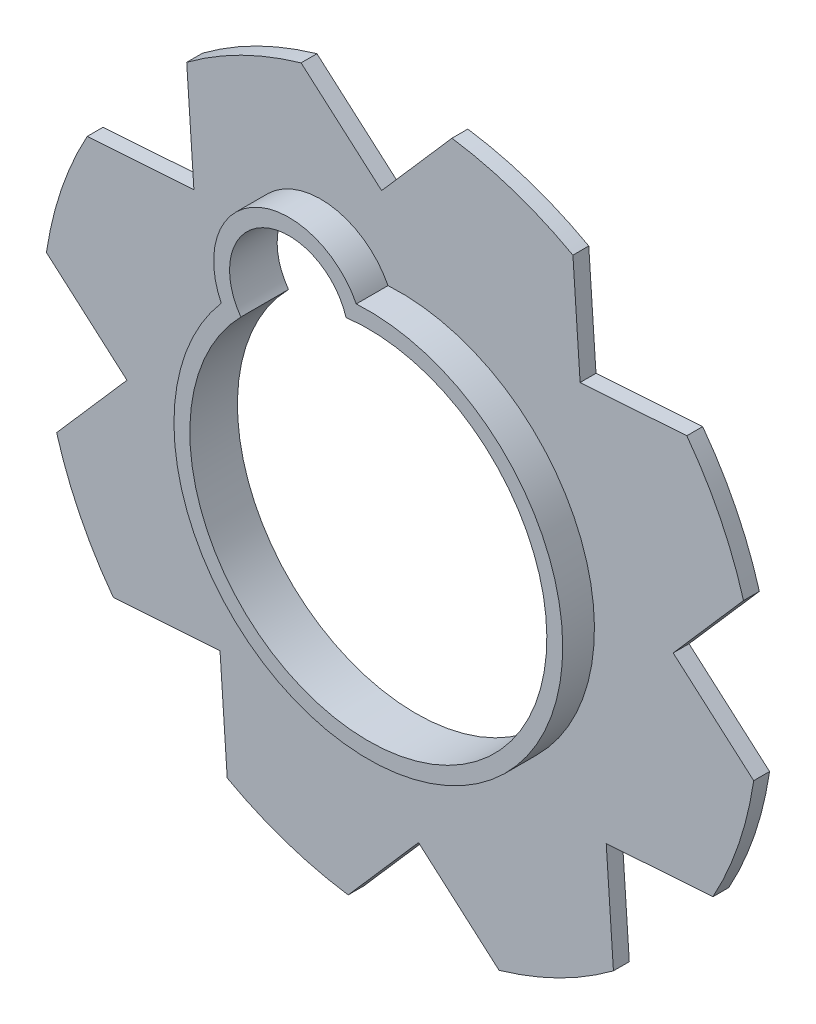
ISO-10303-21;
HEADER;
FILE_DESCRIPTION(('STEP AP214'),'2;1');
FILE_NAME('part.step','',(''),(''),'','','');
FILE_SCHEMA(('AUTOMOTIVE_DESIGN { 1 0 10303 214 1 1 1 1 }'));
ENDSEC;
DATA;
#1=APPLICATION_CONTEXT('core data for automotive mechanical design processes');
#2=APPLICATION_PROTOCOL_DEFINITION('international standard','automotive_design',2000,#1);
#3=PRODUCT_CONTEXT('',#1,'mechanical');
#4=PRODUCT('Part','Part','',(#3));
#5=PRODUCT_RELATED_PRODUCT_CATEGORY('part','',(#4));
#6=PRODUCT_DEFINITION_FORMATION('','',#4);
#7=PRODUCT_DEFINITION_CONTEXT('part definition',#1,'design');
#8=PRODUCT_DEFINITION('design','',#6,#7);
#9=PRODUCT_DEFINITION_SHAPE('','',#8);
#10=(LENGTH_UNIT() NAMED_UNIT(*) SI_UNIT(.MILLI.,.METRE.));
#11=(NAMED_UNIT(*) PLANE_ANGLE_UNIT() SI_UNIT($,.RADIAN.));
#12=(NAMED_UNIT(*) SI_UNIT($,.STERADIAN.) SOLID_ANGLE_UNIT());
#13=UNCERTAINTY_MEASURE_WITH_UNIT(LENGTH_MEASURE(1.E-05),#10,'distance_accuracy_value','');
#14=(GEOMETRIC_REPRESENTATION_CONTEXT(3) GLOBAL_UNCERTAINTY_ASSIGNED_CONTEXT((#13)) GLOBAL_UNIT_ASSIGNED_CONTEXT((#10,
#11,#12)) REPRESENTATION_CONTEXT('',''));
#15=CARTESIAN_POINT('',(0.,0.,0.));
#16=DIRECTION('',(0.,0.,1.));
#17=DIRECTION('',(1.,0.,0.));
#18=AXIS2_PLACEMENT_3D('',#15,#16,#17);
#19=CARTESIAN_POINT('',(0.,0.,2.));
#20=DIRECTION('',(0.,0.,1.));
#21=DIRECTION('',(1.,0.,0.));
#22=AXIS2_PLACEMENT_3D('',#19,#20,#21);
#23=PLANE('',#22);
#24=CARTESIAN_POINT('',(0.,0.,2.));
#25=DIRECTION('',(0.,0.,1.));
#26=DIRECTION('',(1.,0.,0.));
#27=AXIS2_PLACEMENT_3D('',#24,#25,#26);
#28=CIRCLE('',#27,45.05);
#29=CARTESIAN_POINT('',(-21.7857233383085,-39.4320270671783,2.));
#30=VERTEX_POINT('',#29);
#31=CARTESIAN_POINT('',(-6.53955185475153,-44.5728253708357,2.));
#32=VERTEX_POINT('',#31);
#33=EDGE_CURVE('E253',#30,#32,#28,.T.);
#34=ORIENTED_EDGE('',*,*,#33,.T.);
#35=DIRECTION('',(0.657814353968905,0.753180108415293,0.));
#36=VECTOR('',#35,1.);
#37=CARTESIAN_POINT('',(-6.53955185475153,-44.5728253708357,2.));
#38=LINE('',#37,#36);
#39=CARTESIAN_POINT('',(2.32646512233945,-34.4214694636144,2.));
#40=VERTEX_POINT('',#39);
#41=EDGE_CURVE('E256',#32,#40,#38,.T.);
#42=ORIENTED_EDGE('',*,*,#41,.T.);
#43=DIRECTION('',(0.753180108415293,-0.657814353968905,0.));
#44=VECTOR('',#43,1.);
#45=CARTESIAN_POINT('',(2.32646512233945,-34.4214694636144,2.));
#46=LINE('',#45,#44);
#47=CARTESIAN_POINT('',(12.4778210295607,-43.2874864407054,2.));
#48=VERTEX_POINT('',#47);
#49=EDGE_CURVE('E259',#40,#48,#46,.T.);
#50=ORIENTED_EDGE('',*,*,#49,.T.);
#51=CARTESIAN_POINT('',(0.,0.,2.));
#52=DIRECTION('',(0.,0.,1.));
#53=DIRECTION('',(1.,0.,0.));
#54=AXIS2_PLACEMENT_3D('',#51,#52,#53);
#55=CIRCLE('',#54,45.05);
#56=CARTESIAN_POINT('',(26.8935856139459,-36.1419085387775,2.));
#57=VERTEX_POINT('',#56);
#58=EDGE_CURVE('E261',#48,#57,#55,.T.);
#59=ORIENTED_EDGE('',*,*,#58,.T.);
#60=DIRECTION('',(-0.0674337716620119,0.997723752568533,0.));
#61=VECTOR('',#60,1.);
#62=CARTESIAN_POINT('',(26.8935856139459,-36.1419085387775,2.));
#63=LINE('',#62,#61);
#64=CARTESIAN_POINT('',(25.9847137403277,-22.6945952119272,2.));
#65=VERTEX_POINT('',#64);
#66=EDGE_CURVE('E263',#57,#65,#63,.T.);
#67=ORIENTED_EDGE('',*,*,#66,.T.);
#68=DIRECTION('',(0.997723752568533,0.0674337716620136,0.));
#69=VECTOR('',#68,1.);
#70=CARTESIAN_POINT('',(25.9847137403277,-22.6945952119272,2.));
#71=LINE('',#70,#69);
#72=CARTESIAN_POINT('',(39.432027067178,-21.7857233383089,2.));
#73=VERTEX_POINT('',#72);
#74=EDGE_CURVE('E265',#65,#73,#71,.T.);
#75=ORIENTED_EDGE('',*,*,#74,.T.);
#76=CARTESIAN_POINT('',(0.,0.,2.));
#77=DIRECTION('',(0.,0.,1.));
#78=DIRECTION('',(1.,0.,0.));
#79=AXIS2_PLACEMENT_3D('',#76,#77,#78);
#80=CIRCLE('',#79,45.05);
#81=CARTESIAN_POINT('',(44.5728253708357,-6.5395518547514,2.));
#82=VERTEX_POINT('',#81);
#83=EDGE_CURVE('E267',#73,#82,#80,.T.);
#84=ORIENTED_EDGE('',*,*,#83,.T.);
#85=DIRECTION('',(-0.753180108415294,0.657814353968903,0.));
#86=VECTOR('',#85,1.);
#87=CARTESIAN_POINT('',(44.5728253708357,-6.5395518547514,2.));
#88=LINE('',#87,#86);
#89=CARTESIAN_POINT('',(34.4214694636144,2.32646512233956,2.));
#90=VERTEX_POINT('',#89);
#91=EDGE_CURVE('E269',#82,#90,#88,.T.);
#92=ORIENTED_EDGE('',*,*,#91,.T.);
#93=DIRECTION('',(0.657814353968902,0.753180108415295,0.));
#94=VECTOR('',#93,1.);
#95=CARTESIAN_POINT('',(34.4214694636144,2.32646512233956,2.));
#96=LINE('',#95,#94);
#97=CARTESIAN_POINT('',(43.2874864407053,12.4778210295609,2.));
#98=VERTEX_POINT('',#97);
#99=EDGE_CURVE('E271',#90,#98,#96,.T.);
#100=ORIENTED_EDGE('',*,*,#99,.T.);
#101=CARTESIAN_POINT('',(0.,0.,2.));
#102=DIRECTION('',(0.,0.,1.));
#103=DIRECTION('',(1.,0.,0.));
#104=AXIS2_PLACEMENT_3D('',#101,#102,#103);
#105=CIRCLE('',#104,45.05);
#106=CARTESIAN_POINT('',(36.1419085387773,26.8935856139463,2.));
#107=VERTEX_POINT('',#106);
#108=EDGE_CURVE('E273',#98,#107,#105,.T.);
#109=ORIENTED_EDGE('',*,*,#108,.T.);
#110=DIRECTION('',(-0.997723752568532,-0.0674337716620241,0.));
#111=VECTOR('',#110,1.);
#112=CARTESIAN_POINT('',(36.1419085387773,26.8935856139463,2.));
#113=LINE('',#112,#111);
#114=CARTESIAN_POINT('',(22.6945952119269,25.9847137403279,2.));
#115=VERTEX_POINT('',#114);
#116=EDGE_CURVE('E275',#107,#115,#113,.T.);
#117=ORIENTED_EDGE('',*,*,#116,.T.);
#118=DIRECTION('',(-0.0674337716620246,0.997723752568532,0.));
#119=VECTOR('',#118,1.);
#120=CARTESIAN_POINT('',(22.6945952119269,25.9847137403279,2.));
#121=LINE('',#120,#119);
#122=CARTESIAN_POINT('',(21.7857233383085,39.4320270671783,2.));
#123=VERTEX_POINT('',#122);
#124=EDGE_CURVE('E277',#115,#123,#121,.T.);
#125=ORIENTED_EDGE('',*,*,#124,.T.);
#126=CARTESIAN_POINT('',(0.,0.,2.));
#127=DIRECTION('',(0.,0.,1.));
#128=DIRECTION('',(1.,0.,0.));
#129=AXIS2_PLACEMENT_3D('',#126,#127,#128);
#130=CIRCLE('',#129,45.05);
#131=CARTESIAN_POINT('',(6.53955185475123,44.5728253708357,2.));
#132=VERTEX_POINT('',#131);
#133=EDGE_CURVE('E279',#123,#132,#130,.T.);
#134=ORIENTED_EDGE('',*,*,#133,.T.);
#135=DIRECTION('',(-0.657814353968901,-0.753180108415296,0.));
#136=VECTOR('',#135,1.);
#137=CARTESIAN_POINT('',(6.53955185475123,44.5728253708357,2.));
#138=LINE('',#137,#136);
#139=CARTESIAN_POINT('',(-2.32646512233969,34.4214694636144,2.));
#140=VERTEX_POINT('',#139);
#141=EDGE_CURVE('E281',#132,#140,#138,.T.);
#142=ORIENTED_EDGE('',*,*,#141,.T.);
#143=DIRECTION('',(-0.753180108415297,0.6578143539689,0.));
#144=VECTOR('',#143,1.);
#145=CARTESIAN_POINT('',(-2.32646512233969,34.4214694636144,2.));
#146=LINE('',#145,#144);
#147=CARTESIAN_POINT('',(-12.477821029561,43.2874864407053,2.));
#148=VERTEX_POINT('',#147);
#149=EDGE_CURVE('E283',#140,#148,#146,.T.);
#150=ORIENTED_EDGE('',*,*,#149,.T.);
#151=CARTESIAN_POINT('',(0.,0.,2.));
#152=DIRECTION('',(0.,0.,1.));
#153=DIRECTION('',(1.,0.,0.));
#154=AXIS2_PLACEMENT_3D('',#151,#152,#153);
#155=CIRCLE('',#154,45.05);
#156=CARTESIAN_POINT('',(-26.8935856139462,36.1419085387774,2.));
#157=VERTEX_POINT('',#156);
#158=EDGE_CURVE('E285',#148,#157,#155,.T.);
#159=ORIENTED_EDGE('',*,*,#158,.T.);
#160=DIRECTION('',(0.0674337716620215,-0.997723752568533,0.));
#161=VECTOR('',#160,1.);
#162=CARTESIAN_POINT('',(-26.8935856139462,36.1419085387774,2.));
#163=LINE('',#162,#161);
#164=CARTESIAN_POINT('',(-25.9847137403278,22.694595211927,2.));
#165=VERTEX_POINT('',#164);
#166=EDGE_CURVE('E287',#157,#165,#163,.T.);
#167=ORIENTED_EDGE('',*,*,#166,.T.);
#168=DIRECTION('',(-0.997723752568533,-0.0674337716620208,0.));
#169=VECTOR('',#168,1.);
#170=CARTESIAN_POINT('',(-25.9847137403278,22.694595211927,2.));
#171=LINE('',#170,#169);
#172=CARTESIAN_POINT('',(-39.4320270671782,21.7857233383086,2.));
#173=VERTEX_POINT('',#172);
#174=EDGE_CURVE('E289',#165,#173,#171,.T.);
#175=ORIENTED_EDGE('',*,*,#174,.T.);
#176=CARTESIAN_POINT('',(0.,0.,2.));
#177=DIRECTION('',(0.,0.,1.));
#178=DIRECTION('',(1.,0.,0.));
#179=AXIS2_PLACEMENT_3D('',#176,#177,#178);
#180=CIRCLE('',#179,45.05);
#181=CARTESIAN_POINT('',(-44.5728253708358,6.53955185475107,2.));
#182=VERTEX_POINT('',#181);
#183=EDGE_CURVE('E291',#173,#182,#180,.T.);
#184=ORIENTED_EDGE('',*,*,#183,.T.);
#185=DIRECTION('',(0.753180108415299,-0.657814353968897,0.));
#186=VECTOR('',#185,1.);
#187=CARTESIAN_POINT('',(-44.5728253708358,6.53955185475107,2.));
#188=LINE('',#187,#186);
#189=CARTESIAN_POINT('',(-34.4214694636144,-2.3264651223398,2.));
#190=VERTEX_POINT('',#189);
#191=EDGE_CURVE('E293',#182,#190,#188,.T.);
#192=ORIENTED_EDGE('',*,*,#191,.T.);
#193=DIRECTION('',(-0.657814353968897,-0.753180108415299,0.));
#194=VECTOR('',#193,1.);
#195=CARTESIAN_POINT('',(-34.4214694636144,-2.3264651223398,2.));
#196=LINE('',#195,#194);
#197=CARTESIAN_POINT('',(-43.2874864407052,-12.4778210295612,2.));
#198=VERTEX_POINT('',#197);
#199=EDGE_CURVE('E295',#190,#198,#196,.T.);
#200=ORIENTED_EDGE('',*,*,#199,.T.);
#201=CARTESIAN_POINT('',(0.,0.,2.));
#202=DIRECTION('',(0.,0.,1.));
#203=DIRECTION('',(1.,0.,0.));
#204=AXIS2_PLACEMENT_3D('',#201,#202,#203);
#205=CIRCLE('',#204,45.05);
#206=CARTESIAN_POINT('',(-36.1419085387773,-26.8935856139463,2.));
#207=VERTEX_POINT('',#206);
#208=EDGE_CURVE('E297',#198,#207,#205,.T.);
#209=ORIENTED_EDGE('',*,*,#208,.T.);
#210=DIRECTION('',(0.997723752568533,0.0674337716620222,0.));
#211=VECTOR('',#210,1.);
#212=CARTESIAN_POINT('',(-36.1419085387773,-26.8935856139463,2.));
#213=LINE('',#212,#211);
#214=CARTESIAN_POINT('',(-22.6945952119269,-25.9847137403279,2.));
#215=VERTEX_POINT('',#214);
#216=EDGE_CURVE('E299',#207,#215,#213,.T.);
#217=ORIENTED_EDGE('',*,*,#216,.T.);
#218=DIRECTION('',(0.0674337716620251,-0.997723752568532,0.));
#219=VECTOR('',#218,1.);
#220=CARTESIAN_POINT('',(-22.6945952119269,-25.9847137403279,2.));
#221=LINE('',#220,#219);
#222=EDGE_CURVE('E301',#215,#30,#221,.T.);
#223=ORIENTED_EDGE('',*,*,#222,.T.);
#224=EDGE_LOOP('',(#34,#42,#50,#59,#67,#75,#84,#92,#100,#109,#117,#125,#134,#142,#150,#159,#167,
#175,#184,#192,#200,#209,#217,#223));
#225=FACE_BOUND('',#224,.T.);
#226=CARTESIAN_POINT('',(-9.99254321153289,20.1593422552832,2.));
#227=DIRECTION('',(0.,0.,1.));
#228=DIRECTION('',(1.,0.,0.));
#229=AXIS2_PLACEMENT_3D('',#226,#227,#228);
#230=CIRCLE('',#229,9.50000000000001);
#231=CARTESIAN_POINT('',(-1.5181578262661,24.4529179611462,2.));
#232=VERTEX_POINT('',#231);
#233=CARTESIAN_POINT('',(-18.5409474354036,16.0150950105705,2.));
#234=VERTEX_POINT('',#233);
#235=EDGE_CURVE('E241',#232,#234,#230,.T.);
#236=ORIENTED_EDGE('',*,*,#235,.F.);
#237=CARTESIAN_POINT('',(0.,0.,2.));
#238=DIRECTION('',(0.,0.,1.));
#239=DIRECTION('',(1.,0.,0.));
#240=AXIS2_PLACEMENT_3D('',#237,#238,#239);
#241=CIRCLE('',#240,24.5);
#242=EDGE_CURVE('E48',#234,#232,#241,.T.);
#243=ORIENTED_EDGE('',*,*,#242,.F.);
#244=EDGE_LOOP('',(#236,#243));
#245=FACE_BOUND('',#244,.T.);
#246=ADVANCED_FACE('F33',(#225,#245),#23,.T.);
#247=CARTESIAN_POINT('',(0.,0.,0.));
#248=DIRECTION('',(0.,0.,1.));
#249=DIRECTION('',(1.,0.,0.));
#250=AXIS2_PLACEMENT_3D('',#247,#248,#249);
#251=PLANE('',#250);
#252=CARTESIAN_POINT('',(0.,0.,0.));
#253=DIRECTION('',(0.,0.,1.));
#254=DIRECTION('',(1.,0.,0.));
#255=AXIS2_PLACEMENT_3D('',#252,#253,#254);
#256=CIRCLE('',#255,45.05);
#257=CARTESIAN_POINT('',(-21.7857233383085,-39.4320270671783,0.));
#258=VERTEX_POINT('',#257);
#259=CARTESIAN_POINT('',(-6.53955185475153,-44.5728253708357,0.));
#260=VERTEX_POINT('',#259);
#261=EDGE_CURVE('E252',#258,#260,#256,.T.);
#262=ORIENTED_EDGE('',*,*,#261,.F.);
#263=DIRECTION('',(0.0674337716620251,-0.997723752568532,0.));
#264=VECTOR('',#263,1.);
#265=CARTESIAN_POINT('',(-22.6945952119269,-25.9847137403279,0.));
#266=LINE('',#265,#264);
#267=CARTESIAN_POINT('',(-22.6945952119269,-25.9847137403279,0.));
#268=VERTEX_POINT('',#267);
#269=EDGE_CURVE('E257',#268,#258,#266,.T.);
#270=ORIENTED_EDGE('',*,*,#269,.F.);
#271=DIRECTION('',(0.997723752568533,0.0674337716620222,0.));
#272=VECTOR('',#271,1.);
#273=CARTESIAN_POINT('',(-36.1419085387773,-26.8935856139463,0.));
#274=LINE('',#273,#272);
#275=CARTESIAN_POINT('',(-36.1419085387773,-26.8935856139463,0.));
#276=VERTEX_POINT('',#275);
#277=EDGE_CURVE('E348',#276,#268,#274,.T.);
#278=ORIENTED_EDGE('',*,*,#277,.F.);
#279=CARTESIAN_POINT('',(0.,0.,0.));
#280=DIRECTION('',(0.,0.,1.));
#281=DIRECTION('',(1.,0.,0.));
#282=AXIS2_PLACEMENT_3D('',#279,#280,#281);
#283=CIRCLE('',#282,45.05);
#284=CARTESIAN_POINT('',(-43.2874864407052,-12.4778210295612,0.));
#285=VERTEX_POINT('',#284);
#286=EDGE_CURVE('E346',#285,#276,#283,.T.);
#287=ORIENTED_EDGE('',*,*,#286,.F.);
#288=DIRECTION('',(-0.657814353968897,-0.753180108415299,0.));
#289=VECTOR('',#288,1.);
#290=CARTESIAN_POINT('',(-34.4214694636144,-2.3264651223398,0.));
#291=LINE('',#290,#289);
#292=CARTESIAN_POINT('',(-34.4214694636144,-2.3264651223398,0.));
#293=VERTEX_POINT('',#292);
#294=EDGE_CURVE('E344',#293,#285,#291,.T.);
#295=ORIENTED_EDGE('',*,*,#294,.F.);
#296=DIRECTION('',(0.753180108415299,-0.657814353968897,0.));
#297=VECTOR('',#296,1.);
#298=CARTESIAN_POINT('',(-44.5728253708358,6.53955185475107,0.));
#299=LINE('',#298,#297);
#300=CARTESIAN_POINT('',(-44.5728253708358,6.53955185475107,0.));
#301=VERTEX_POINT('',#300);
#302=EDGE_CURVE('E342',#301,#293,#299,.T.);
#303=ORIENTED_EDGE('',*,*,#302,.F.);
#304=CARTESIAN_POINT('',(0.,0.,0.));
#305=DIRECTION('',(0.,0.,1.));
#306=DIRECTION('',(1.,0.,0.));
#307=AXIS2_PLACEMENT_3D('',#304,#305,#306);
#308=CIRCLE('',#307,45.05);
#309=CARTESIAN_POINT('',(-39.4320270671782,21.7857233383086,0.));
#310=VERTEX_POINT('',#309);
#311=EDGE_CURVE('E340',#310,#301,#308,.T.);
#312=ORIENTED_EDGE('',*,*,#311,.F.);
#313=DIRECTION('',(-0.997723752568533,-0.0674337716620208,0.));
#314=VECTOR('',#313,1.);
#315=CARTESIAN_POINT('',(-25.9847137403278,22.694595211927,0.));
#316=LINE('',#315,#314);
#317=CARTESIAN_POINT('',(-25.9847137403278,22.694595211927,0.));
#318=VERTEX_POINT('',#317);
#319=EDGE_CURVE('E338',#318,#310,#316,.T.);
#320=ORIENTED_EDGE('',*,*,#319,.F.);
#321=DIRECTION('',(0.0674337716620215,-0.997723752568533,0.));
#322=VECTOR('',#321,1.);
#323=CARTESIAN_POINT('',(-26.8935856139462,36.1419085387774,0.));
#324=LINE('',#323,#322);
#325=CARTESIAN_POINT('',(-26.8935856139462,36.1419085387774,0.));
#326=VERTEX_POINT('',#325);
#327=EDGE_CURVE('E336',#326,#318,#324,.T.);
#328=ORIENTED_EDGE('',*,*,#327,.F.);
#329=CARTESIAN_POINT('',(0.,0.,0.));
#330=DIRECTION('',(0.,0.,1.));
#331=DIRECTION('',(1.,0.,0.));
#332=AXIS2_PLACEMENT_3D('',#329,#330,#331);
#333=CIRCLE('',#332,45.05);
#334=CARTESIAN_POINT('',(-12.477821029561,43.2874864407053,0.));
#335=VERTEX_POINT('',#334);
#336=EDGE_CURVE('E334',#335,#326,#333,.T.);
#337=ORIENTED_EDGE('',*,*,#336,.F.);
#338=DIRECTION('',(-0.753180108415297,0.6578143539689,0.));
#339=VECTOR('',#338,1.);
#340=CARTESIAN_POINT('',(-2.32646512233969,34.4214694636144,0.));
#341=LINE('',#340,#339);
#342=CARTESIAN_POINT('',(-2.32646512233969,34.4214694636144,0.));
#343=VERTEX_POINT('',#342);
#344=EDGE_CURVE('E332',#343,#335,#341,.T.);
#345=ORIENTED_EDGE('',*,*,#344,.F.);
#346=DIRECTION('',(-0.657814353968901,-0.753180108415296,0.));
#347=VECTOR('',#346,1.);
#348=CARTESIAN_POINT('',(6.53955185475123,44.5728253708357,0.));
#349=LINE('',#348,#347);
#350=CARTESIAN_POINT('',(6.53955185475123,44.5728253708357,0.));
#351=VERTEX_POINT('',#350);
#352=EDGE_CURVE('E330',#351,#343,#349,.T.);
#353=ORIENTED_EDGE('',*,*,#352,.F.);
#354=CARTESIAN_POINT('',(0.,0.,0.));
#355=DIRECTION('',(0.,0.,1.));
#356=DIRECTION('',(1.,0.,0.));
#357=AXIS2_PLACEMENT_3D('',#354,#355,#356);
#358=CIRCLE('',#357,45.05);
#359=CARTESIAN_POINT('',(21.7857233383085,39.4320270671783,0.));
#360=VERTEX_POINT('',#359);
#361=EDGE_CURVE('E328',#360,#351,#358,.T.);
#362=ORIENTED_EDGE('',*,*,#361,.F.);
#363=DIRECTION('',(-0.0674337716620246,0.997723752568532,0.));
#364=VECTOR('',#363,1.);
#365=CARTESIAN_POINT('',(22.6945952119269,25.9847137403279,0.));
#366=LINE('',#365,#364);
#367=CARTESIAN_POINT('',(22.6945952119269,25.9847137403279,0.));
#368=VERTEX_POINT('',#367);
#369=EDGE_CURVE('E326',#368,#360,#366,.T.);
#370=ORIENTED_EDGE('',*,*,#369,.F.);
#371=DIRECTION('',(-0.997723752568532,-0.0674337716620241,0.));
#372=VECTOR('',#371,1.);
#373=CARTESIAN_POINT('',(36.1419085387773,26.8935856139463,0.));
#374=LINE('',#373,#372);
#375=CARTESIAN_POINT('',(36.1419085387773,26.8935856139463,0.));
#376=VERTEX_POINT('',#375);
#377=EDGE_CURVE('E324',#376,#368,#374,.T.);
#378=ORIENTED_EDGE('',*,*,#377,.F.);
#379=CARTESIAN_POINT('',(0.,0.,0.));
#380=DIRECTION('',(0.,0.,1.));
#381=DIRECTION('',(1.,0.,0.));
#382=AXIS2_PLACEMENT_3D('',#379,#380,#381);
#383=CIRCLE('',#382,45.05);
#384=CARTESIAN_POINT('',(43.2874864407053,12.4778210295609,0.));
#385=VERTEX_POINT('',#384);
#386=EDGE_CURVE('E322',#385,#376,#383,.T.);
#387=ORIENTED_EDGE('',*,*,#386,.F.);
#388=DIRECTION('',(0.657814353968902,0.753180108415295,0.));
#389=VECTOR('',#388,1.);
#390=CARTESIAN_POINT('',(34.4214694636144,2.32646512233956,0.));
#391=LINE('',#390,#389);
#392=CARTESIAN_POINT('',(34.4214694636144,2.32646512233956,0.));
#393=VERTEX_POINT('',#392);
#394=EDGE_CURVE('E320',#393,#385,#391,.T.);
#395=ORIENTED_EDGE('',*,*,#394,.F.);
#396=DIRECTION('',(-0.753180108415294,0.657814353968903,0.));
#397=VECTOR('',#396,1.);
#398=CARTESIAN_POINT('',(44.5728253708357,-6.5395518547514,0.));
#399=LINE('',#398,#397);
#400=CARTESIAN_POINT('',(44.5728253708357,-6.5395518547514,0.));
#401=VERTEX_POINT('',#400);
#402=EDGE_CURVE('E318',#401,#393,#399,.T.);
#403=ORIENTED_EDGE('',*,*,#402,.F.);
#404=CARTESIAN_POINT('',(0.,0.,0.));
#405=DIRECTION('',(0.,0.,1.));
#406=DIRECTION('',(1.,0.,0.));
#407=AXIS2_PLACEMENT_3D('',#404,#405,#406);
#408=CIRCLE('',#407,45.05);
#409=CARTESIAN_POINT('',(39.432027067178,-21.7857233383089,0.));
#410=VERTEX_POINT('',#409);
#411=EDGE_CURVE('E316',#410,#401,#408,.T.);
#412=ORIENTED_EDGE('',*,*,#411,.F.);
#413=DIRECTION('',(0.997723752568533,0.0674337716620136,0.));
#414=VECTOR('',#413,1.);
#415=CARTESIAN_POINT('',(25.9847137403277,-22.6945952119272,0.));
#416=LINE('',#415,#414);
#417=CARTESIAN_POINT('',(25.9847137403277,-22.6945952119272,0.));
#418=VERTEX_POINT('',#417);
#419=EDGE_CURVE('E314',#418,#410,#416,.T.);
#420=ORIENTED_EDGE('',*,*,#419,.F.);
#421=DIRECTION('',(-0.0674337716620119,0.997723752568533,0.));
#422=VECTOR('',#421,1.);
#423=CARTESIAN_POINT('',(26.8935856139459,-36.1419085387775,0.));
#424=LINE('',#423,#422);
#425=CARTESIAN_POINT('',(26.8935856139459,-36.1419085387775,0.));
#426=VERTEX_POINT('',#425);
#427=EDGE_CURVE('E312',#426,#418,#424,.T.);
#428=ORIENTED_EDGE('',*,*,#427,.F.);
#429=CARTESIAN_POINT('',(0.,0.,0.));
#430=DIRECTION('',(0.,0.,1.));
#431=DIRECTION('',(1.,0.,0.));
#432=AXIS2_PLACEMENT_3D('',#429,#430,#431);
#433=CIRCLE('',#432,45.05);
#434=CARTESIAN_POINT('',(12.4778210295607,-43.2874864407054,0.));
#435=VERTEX_POINT('',#434);
#436=EDGE_CURVE('E310',#435,#426,#433,.T.);
#437=ORIENTED_EDGE('',*,*,#436,.F.);
#438=DIRECTION('',(0.753180108415293,-0.657814353968905,0.));
#439=VECTOR('',#438,1.);
#440=CARTESIAN_POINT('',(2.32646512233945,-34.4214694636144,0.));
#441=LINE('',#440,#439);
#442=CARTESIAN_POINT('',(2.32646512233945,-34.4214694636144,0.));
#443=VERTEX_POINT('',#442);
#444=EDGE_CURVE('E308',#443,#435,#441,.T.);
#445=ORIENTED_EDGE('',*,*,#444,.F.);
#446=DIRECTION('',(0.657814353968905,0.753180108415293,0.));
#447=VECTOR('',#446,1.);
#448=CARTESIAN_POINT('',(-6.53955185475153,-44.5728253708357,0.));
#449=LINE('',#448,#447);
#450=EDGE_CURVE('E306',#260,#443,#449,.T.);
#451=ORIENTED_EDGE('',*,*,#450,.F.);
#452=EDGE_LOOP('',(#262,#270,#278,#287,#295,#303,#312,#320,#328,#337,#345,#353,#362,#370,#378,
#387,#395,#403,#412,#420,#428,#437,#445,#451));
#453=FACE_BOUND('',#452,.T.);
#454=CARTESIAN_POINT('',(-9.99254321153289,20.1593422552832,0.));
#455=DIRECTION('',(0.,0.,1.));
#456=DIRECTION('',(1.,0.,0.));
#457=AXIS2_PLACEMENT_3D('',#454,#455,#456);
#458=CIRCLE('',#457,7.5);
#459=CARTESIAN_POINT('',(-2.81160874661068,22.3236389564063,0.));
#460=VERTEX_POINT('',#459);
#461=CARTESIAN_POINT('',(-16.0631950973959,15.7551186369064,0.));
#462=VERTEX_POINT('',#461);
#463=EDGE_CURVE('E56',#460,#462,#458,.T.);
#464=ORIENTED_EDGE('',*,*,#463,.T.);
#465=CARTESIAN_POINT('',(0.,0.,0.));
#466=DIRECTION('',(0.,0.,1.));
#467=DIRECTION('',(1.,0.,0.));
#468=AXIS2_PLACEMENT_3D('',#465,#466,#467);
#469=CIRCLE('',#468,22.5);
#470=EDGE_CURVE('E228',#462,#460,#469,.T.);
#471=ORIENTED_EDGE('',*,*,#470,.T.);
#472=EDGE_LOOP('',(#464,#471));
#473=FACE_BOUND('',#472,.T.);
#474=ADVANCED_FACE('F426',(#453,#473),#251,.F.);
#475=CARTESIAN_POINT('',(0.,0.,2.));
#476=DIRECTION('',(0.,0.,-1.));
#477=DIRECTION('',(-1.,0.,0.));
#478=AXIS2_PLACEMENT_3D('',#475,#476,#477);
#479=CYLINDRICAL_SURFACE('',#478,45.05);
#480=ORIENTED_EDGE('',*,*,#261,.T.);
#481=DIRECTION('',(0.,0.,-1.));
#482=VECTOR('',#481,1.);
#483=CARTESIAN_POINT('',(-6.53955185475153,-44.5728253708357,2.));
#484=LINE('',#483,#482);
#485=EDGE_CURVE('E11',#32,#260,#484,.T.);
#486=ORIENTED_EDGE('',*,*,#485,.F.);
#487=ORIENTED_EDGE('',*,*,#33,.F.);
#488=DIRECTION('',(0.,0.,-1.));
#489=VECTOR('',#488,1.);
#490=CARTESIAN_POINT('',(-21.7857233383085,-39.4320270671783,2.));
#491=LINE('',#490,#489);
#492=EDGE_CURVE('E303',#30,#258,#491,.T.);
#493=ORIENTED_EDGE('',*,*,#492,.T.);
#494=EDGE_LOOP('',(#480,#486,#487,#493));
#495=FACE_BOUND('',#494,.T.);
#496=ADVANCED_FACE('F35',(#495),#479,.T.);
#497=CARTESIAN_POINT('',(-6.53955185475153,-44.5728253708357,2.));
#498=DIRECTION('',(-0.753180108415293,0.657814353968905,0.));
#499=DIRECTION('',(-0.657814353968905,-0.753180108415293,0.));
#500=AXIS2_PLACEMENT_3D('',#497,#498,#499);
#501=PLANE('',#500);
#502=ORIENTED_EDGE('',*,*,#450,.T.);
#503=DIRECTION('',(0.,0.,-1.));
#504=VECTOR('',#503,1.);
#505=CARTESIAN_POINT('',(2.32646512233945,-34.4214694636144,2.));
#506=LINE('',#505,#504);
#507=EDGE_CURVE('E41',#40,#443,#506,.T.);
#508=ORIENTED_EDGE('',*,*,#507,.F.);
#509=ORIENTED_EDGE('',*,*,#41,.F.);
#510=ORIENTED_EDGE('',*,*,#485,.T.);
#511=EDGE_LOOP('',(#502,#508,#509,#510));
#512=FACE_BOUND('',#511,.T.);
#513=ADVANCED_FACE('F444',(#512),#501,.F.);
#514=CARTESIAN_POINT('',(2.32646512233945,-34.4214694636144,2.));
#515=DIRECTION('',(0.657814353968905,0.753180108415293,0.));
#516=DIRECTION('',(-0.753180108415293,0.657814353968905,0.));
#517=AXIS2_PLACEMENT_3D('',#514,#515,#516);
#518=PLANE('',#517);
#519=ORIENTED_EDGE('',*,*,#444,.T.);
#520=DIRECTION('',(0.,0.,-1.));
#521=VECTOR('',#520,1.);
#522=CARTESIAN_POINT('',(12.4778210295607,-43.2874864407054,2.));
#523=LINE('',#522,#521);
#524=EDGE_CURVE('E413',#48,#435,#523,.T.);
#525=ORIENTED_EDGE('',*,*,#524,.F.);
#526=ORIENTED_EDGE('',*,*,#49,.F.);
#527=ORIENTED_EDGE('',*,*,#507,.T.);
#528=EDGE_LOOP('',(#519,#525,#526,#527));
#529=FACE_BOUND('',#528,.T.);
#530=ADVANCED_FACE('F420',(#529),#518,.F.);
#531=CARTESIAN_POINT('',(0.,0.,2.));
#532=DIRECTION('',(0.,0.,-1.));
#533=DIRECTION('',(-1.,0.,0.));
#534=AXIS2_PLACEMENT_3D('',#531,#532,#533);
#535=CYLINDRICAL_SURFACE('',#534,45.05);
#536=ORIENTED_EDGE('',*,*,#436,.T.);
#537=DIRECTION('',(0.,0.,-1.));
#538=VECTOR('',#537,1.);
#539=CARTESIAN_POINT('',(26.8935856139459,-36.1419085387775,2.));
#540=LINE('',#539,#538);
#541=EDGE_CURVE('E410',#57,#426,#540,.T.);
#542=ORIENTED_EDGE('',*,*,#541,.F.);
#543=ORIENTED_EDGE('',*,*,#58,.F.);
#544=ORIENTED_EDGE('',*,*,#524,.T.);
#545=EDGE_LOOP('',(#536,#542,#543,#544));
#546=FACE_BOUND('',#545,.T.);
#547=ADVANCED_FACE('F432',(#546),#535,.T.);
#548=CARTESIAN_POINT('',(26.8935856139459,-36.1419085387775,2.));
#549=DIRECTION('',(-0.997723752568533,-0.0674337716620119,0.));
#550=DIRECTION('',(0.0674337716620119,-0.997723752568533,0.));
#551=AXIS2_PLACEMENT_3D('',#548,#549,#550);
#552=PLANE('',#551);
#553=ORIENTED_EDGE('',*,*,#427,.T.);
#554=DIRECTION('',(0.,0.,-1.));
#555=VECTOR('',#554,1.);
#556=CARTESIAN_POINT('',(25.9847137403277,-22.6945952119272,2.));
#557=LINE('',#556,#555);
#558=EDGE_CURVE('E407',#65,#418,#557,.T.);
#559=ORIENTED_EDGE('',*,*,#558,.F.);
#560=ORIENTED_EDGE('',*,*,#66,.F.);
#561=ORIENTED_EDGE('',*,*,#541,.T.);
#562=EDGE_LOOP('',(#553,#559,#560,#561));
#563=FACE_BOUND('',#562,.T.);
#564=ADVANCED_FACE('F436',(#563),#552,.F.);
#565=CARTESIAN_POINT('',(25.9847137403277,-22.6945952119272,2.));
#566=DIRECTION('',(-0.0674337716620136,0.997723752568533,0.));
#567=DIRECTION('',(-0.997723752568533,-0.0674337716620136,0.));
#568=AXIS2_PLACEMENT_3D('',#565,#566,#567);
#569=PLANE('',#568);
#570=ORIENTED_EDGE('',*,*,#419,.T.);
#571=DIRECTION('',(0.,0.,-1.));
#572=VECTOR('',#571,1.);
#573=CARTESIAN_POINT('',(39.432027067178,-21.7857233383089,2.));
#574=LINE('',#573,#572);
#575=EDGE_CURVE('E404',#73,#410,#574,.T.);
#576=ORIENTED_EDGE('',*,*,#575,.F.);
#577=ORIENTED_EDGE('',*,*,#74,.F.);
#578=ORIENTED_EDGE('',*,*,#558,.T.);
#579=EDGE_LOOP('',(#570,#576,#577,#578));
#580=FACE_BOUND('',#579,.T.);
#581=ADVANCED_FACE('F537',(#580),#569,.F.);
#582=CARTESIAN_POINT('',(0.,0.,2.));
#583=DIRECTION('',(0.,0.,-1.));
#584=DIRECTION('',(-1.,0.,0.));
#585=AXIS2_PLACEMENT_3D('',#582,#583,#584);
#586=CYLINDRICAL_SURFACE('',#585,45.05);
#587=ORIENTED_EDGE('',*,*,#411,.T.);
#588=DIRECTION('',(0.,0.,-1.));
#589=VECTOR('',#588,1.);
#590=CARTESIAN_POINT('',(44.5728253708357,-6.5395518547514,2.));
#591=LINE('',#590,#589);
#592=EDGE_CURVE('E401',#82,#401,#591,.T.);
#593=ORIENTED_EDGE('',*,*,#592,.F.);
#594=ORIENTED_EDGE('',*,*,#83,.F.);
#595=ORIENTED_EDGE('',*,*,#575,.T.);
#596=EDGE_LOOP('',(#587,#593,#594,#595));
#597=FACE_BOUND('',#596,.T.);
#598=ADVANCED_FACE('F535',(#597),#586,.T.);
#599=CARTESIAN_POINT('',(44.5728253708357,-6.5395518547514,2.));
#600=DIRECTION('',(-0.657814353968903,-0.753180108415295,0.));
#601=DIRECTION('',(0.753180108415295,-0.657814353968903,0.));
#602=AXIS2_PLACEMENT_3D('',#599,#600,#601);
#603=PLANE('',#602);
#604=ORIENTED_EDGE('',*,*,#402,.T.);
#605=DIRECTION('',(0.,0.,-1.));
#606=VECTOR('',#605,1.);
#607=CARTESIAN_POINT('',(34.4214694636144,2.32646512233956,2.));
#608=LINE('',#607,#606);
#609=EDGE_CURVE('E398',#90,#393,#608,.T.);
#610=ORIENTED_EDGE('',*,*,#609,.F.);
#611=ORIENTED_EDGE('',*,*,#91,.F.);
#612=ORIENTED_EDGE('',*,*,#592,.T.);
#613=EDGE_LOOP('',(#604,#610,#611,#612));
#614=FACE_BOUND('',#613,.T.);
#615=ADVANCED_FACE('F531',(#614),#603,.F.);
#616=CARTESIAN_POINT('',(34.4214694636144,2.32646512233956,2.));
#617=DIRECTION('',(-0.753180108415295,0.657814353968902,0.));
#618=DIRECTION('',(-0.657814353968902,-0.753180108415295,0.));
#619=AXIS2_PLACEMENT_3D('',#616,#617,#618);
#620=PLANE('',#619);
#621=ORIENTED_EDGE('',*,*,#394,.T.);
#622=DIRECTION('',(0.,0.,-1.));
#623=VECTOR('',#622,1.);
#624=CARTESIAN_POINT('',(43.2874864407053,12.4778210295609,2.));
#625=LINE('',#624,#623);
#626=EDGE_CURVE('E395',#98,#385,#625,.T.);
#627=ORIENTED_EDGE('',*,*,#626,.F.);
#628=ORIENTED_EDGE('',*,*,#99,.F.);
#629=ORIENTED_EDGE('',*,*,#609,.T.);
#630=EDGE_LOOP('',(#621,#627,#628,#629));
#631=FACE_BOUND('',#630,.T.);
#632=ADVANCED_FACE('F526',(#631),#620,.F.);
#633=CARTESIAN_POINT('',(0.,0.,2.));
#634=DIRECTION('',(0.,0.,-1.));
#635=DIRECTION('',(-1.,0.,0.));
#636=AXIS2_PLACEMENT_3D('',#633,#634,#635);
#637=CYLINDRICAL_SURFACE('',#636,45.05);
#638=ORIENTED_EDGE('',*,*,#386,.T.);
#639=DIRECTION('',(0.,0.,-1.));
#640=VECTOR('',#639,1.);
#641=CARTESIAN_POINT('',(36.1419085387773,26.8935856139463,2.));
#642=LINE('',#641,#640);
#643=EDGE_CURVE('E392',#107,#376,#642,.T.);
#644=ORIENTED_EDGE('',*,*,#643,.F.);
#645=ORIENTED_EDGE('',*,*,#108,.F.);
#646=ORIENTED_EDGE('',*,*,#626,.T.);
#647=EDGE_LOOP('',(#638,#644,#645,#646));
#648=FACE_BOUND('',#647,.T.);
#649=ADVANCED_FACE('F520',(#648),#637,.T.);
#650=CARTESIAN_POINT('',(36.1419085387773,26.8935856139463,2.));
#651=DIRECTION('',(0.0674337716620241,-0.997723752568533,0.));
#652=DIRECTION('',(0.997723752568533,0.0674337716620241,0.));
#653=AXIS2_PLACEMENT_3D('',#650,#651,#652);
#654=PLANE('',#653);
#655=ORIENTED_EDGE('',*,*,#377,.T.);
#656=DIRECTION('',(0.,0.,-1.));
#657=VECTOR('',#656,1.);
#658=CARTESIAN_POINT('',(22.6945952119269,25.9847137403279,2.));
#659=LINE('',#658,#657);
#660=EDGE_CURVE('E389',#115,#368,#659,.T.);
#661=ORIENTED_EDGE('',*,*,#660,.F.);
#662=ORIENTED_EDGE('',*,*,#116,.F.);
#663=ORIENTED_EDGE('',*,*,#643,.T.);
#664=EDGE_LOOP('',(#655,#661,#662,#663));
#665=FACE_BOUND('',#664,.T.);
#666=ADVANCED_FACE('F516',(#665),#654,.F.);
#667=CARTESIAN_POINT('',(22.6945952119269,25.9847137403279,2.));
#668=DIRECTION('',(-0.997723752568532,-0.0674337716620246,0.));
#669=DIRECTION('',(0.0674337716620246,-0.997723752568533,0.));
#670=AXIS2_PLACEMENT_3D('',#667,#668,#669);
#671=PLANE('',#670);
#672=ORIENTED_EDGE('',*,*,#369,.T.);
#673=DIRECTION('',(0.,0.,-1.));
#674=VECTOR('',#673,1.);
#675=CARTESIAN_POINT('',(21.7857233383085,39.4320270671783,2.));
#676=LINE('',#675,#674);
#677=EDGE_CURVE('E386',#123,#360,#676,.T.);
#678=ORIENTED_EDGE('',*,*,#677,.F.);
#679=ORIENTED_EDGE('',*,*,#124,.F.);
#680=ORIENTED_EDGE('',*,*,#660,.T.);
#681=EDGE_LOOP('',(#672,#678,#679,#680));
#682=FACE_BOUND('',#681,.T.);
#683=ADVANCED_FACE('F511',(#682),#671,.F.);
#684=CARTESIAN_POINT('',(0.,0.,2.));
#685=DIRECTION('',(0.,0.,-1.));
#686=DIRECTION('',(-1.,0.,0.));
#687=AXIS2_PLACEMENT_3D('',#684,#685,#686);
#688=CYLINDRICAL_SURFACE('',#687,45.05);
#689=ORIENTED_EDGE('',*,*,#361,.T.);
#690=DIRECTION('',(0.,0.,-1.));
#691=VECTOR('',#690,1.);
#692=CARTESIAN_POINT('',(6.53955185475123,44.5728253708357,2.));
#693=LINE('',#692,#691);
#694=EDGE_CURVE('E383',#132,#351,#693,.T.);
#695=ORIENTED_EDGE('',*,*,#694,.F.);
#696=ORIENTED_EDGE('',*,*,#133,.F.);
#697=ORIENTED_EDGE('',*,*,#677,.T.);
#698=EDGE_LOOP('',(#689,#695,#696,#697));
#699=FACE_BOUND('',#698,.T.);
#700=ADVANCED_FACE('F505',(#699),#688,.T.);
#701=CARTESIAN_POINT('',(6.53955185475123,44.5728253708357,2.));
#702=DIRECTION('',(0.753180108415296,-0.657814353968901,0.));
#703=DIRECTION('',(0.657814353968901,0.753180108415297,0.));
#704=AXIS2_PLACEMENT_3D('',#701,#702,#703);
#705=PLANE('',#704);
#706=ORIENTED_EDGE('',*,*,#352,.T.);
#707=DIRECTION('',(0.,0.,-1.));
#708=VECTOR('',#707,1.);
#709=CARTESIAN_POINT('',(-2.32646512233969,34.4214694636144,2.));
#710=LINE('',#709,#708);
#711=EDGE_CURVE('E380',#140,#343,#710,.T.);
#712=ORIENTED_EDGE('',*,*,#711,.F.);
#713=ORIENTED_EDGE('',*,*,#141,.F.);
#714=ORIENTED_EDGE('',*,*,#694,.T.);
#715=EDGE_LOOP('',(#706,#712,#713,#714));
#716=FACE_BOUND('',#715,.T.);
#717=ADVANCED_FACE('F501',(#716),#705,.F.);
#718=CARTESIAN_POINT('',(-2.32646512233969,34.4214694636144,2.));
#719=DIRECTION('',(-0.6578143539689,-0.753180108415297,0.));
#720=DIRECTION('',(0.753180108415297,-0.6578143539689,0.));
#721=AXIS2_PLACEMENT_3D('',#718,#719,#720);
#722=PLANE('',#721);
#723=ORIENTED_EDGE('',*,*,#344,.T.);
#724=DIRECTION('',(0.,0.,-1.));
#725=VECTOR('',#724,1.);
#726=CARTESIAN_POINT('',(-12.477821029561,43.2874864407053,2.));
#727=LINE('',#726,#725);
#728=EDGE_CURVE('E377',#148,#335,#727,.T.);
#729=ORIENTED_EDGE('',*,*,#728,.F.);
#730=ORIENTED_EDGE('',*,*,#149,.F.);
#731=ORIENTED_EDGE('',*,*,#711,.T.);
#732=EDGE_LOOP('',(#723,#729,#730,#731));
#733=FACE_BOUND('',#732,.T.);
#734=ADVANCED_FACE('F496',(#733),#722,.F.);
#735=CARTESIAN_POINT('',(0.,0.,2.));
#736=DIRECTION('',(0.,0.,-1.));
#737=DIRECTION('',(-1.,0.,0.));
#738=AXIS2_PLACEMENT_3D('',#735,#736,#737);
#739=CYLINDRICAL_SURFACE('',#738,45.05);
#740=ORIENTED_EDGE('',*,*,#336,.T.);
#741=DIRECTION('',(0.,0.,-1.));
#742=VECTOR('',#741,1.);
#743=CARTESIAN_POINT('',(-26.8935856139462,36.1419085387774,2.));
#744=LINE('',#743,#742);
#745=EDGE_CURVE('E374',#157,#326,#744,.T.);
#746=ORIENTED_EDGE('',*,*,#745,.F.);
#747=ORIENTED_EDGE('',*,*,#158,.F.);
#748=ORIENTED_EDGE('',*,*,#728,.T.);
#749=EDGE_LOOP('',(#740,#746,#747,#748));
#750=FACE_BOUND('',#749,.T.);
#751=ADVANCED_FACE('F490',(#750),#739,.T.);
#752=CARTESIAN_POINT('',(-26.8935856139462,36.1419085387774,2.));
#753=DIRECTION('',(0.997723752568533,0.0674337716620215,0.));
#754=DIRECTION('',(-0.0674337716620215,0.997723752568533,0.));
#755=AXIS2_PLACEMENT_3D('',#752,#753,#754);
#756=PLANE('',#755);
#757=ORIENTED_EDGE('',*,*,#327,.T.);
#758=DIRECTION('',(0.,0.,-1.));
#759=VECTOR('',#758,1.);
#760=CARTESIAN_POINT('',(-25.9847137403278,22.694595211927,2.));
#761=LINE('',#760,#759);
#762=EDGE_CURVE('E371',#165,#318,#761,.T.);
#763=ORIENTED_EDGE('',*,*,#762,.F.);
#764=ORIENTED_EDGE('',*,*,#166,.F.);
#765=ORIENTED_EDGE('',*,*,#745,.T.);
#766=EDGE_LOOP('',(#757,#763,#764,#765));
#767=FACE_BOUND('',#766,.T.);
#768=ADVANCED_FACE('F486',(#767),#756,.F.);
#769=CARTESIAN_POINT('',(-25.9847137403278,22.694595211927,2.));
#770=DIRECTION('',(0.0674337716620208,-0.997723752568533,0.));
#771=DIRECTION('',(0.997723752568533,0.0674337716620208,0.));
#772=AXIS2_PLACEMENT_3D('',#769,#770,#771);
#773=PLANE('',#772);
#774=ORIENTED_EDGE('',*,*,#319,.T.);
#775=DIRECTION('',(0.,0.,-1.));
#776=VECTOR('',#775,1.);
#777=CARTESIAN_POINT('',(-39.4320270671782,21.7857233383086,2.));
#778=LINE('',#777,#776);
#779=EDGE_CURVE('E368',#173,#310,#778,.T.);
#780=ORIENTED_EDGE('',*,*,#779,.F.);
#781=ORIENTED_EDGE('',*,*,#174,.F.);
#782=ORIENTED_EDGE('',*,*,#762,.T.);
#783=EDGE_LOOP('',(#774,#780,#781,#782));
#784=FACE_BOUND('',#783,.T.);
#785=ADVANCED_FACE('F481',(#784),#773,.F.);
#786=CARTESIAN_POINT('',(0.,0.,2.));
#787=DIRECTION('',(0.,0.,-1.));
#788=DIRECTION('',(-1.,0.,0.));
#789=AXIS2_PLACEMENT_3D('',#786,#787,#788);
#790=CYLINDRICAL_SURFACE('',#789,45.05);
#791=ORIENTED_EDGE('',*,*,#311,.T.);
#792=DIRECTION('',(0.,0.,-1.));
#793=VECTOR('',#792,1.);
#794=CARTESIAN_POINT('',(-44.5728253708358,6.53955185475107,2.));
#795=LINE('',#794,#793);
#796=EDGE_CURVE('E365',#182,#301,#795,.T.);
#797=ORIENTED_EDGE('',*,*,#796,.F.);
#798=ORIENTED_EDGE('',*,*,#183,.F.);
#799=ORIENTED_EDGE('',*,*,#779,.T.);
#800=EDGE_LOOP('',(#791,#797,#798,#799));
#801=FACE_BOUND('',#800,.T.);
#802=ADVANCED_FACE('F475',(#801),#790,.T.);
#803=CARTESIAN_POINT('',(-44.5728253708358,6.53955185475107,2.));
#804=DIRECTION('',(0.657814353968897,0.753180108415299,0.));
#805=DIRECTION('',(-0.753180108415299,0.657814353968897,0.));
#806=AXIS2_PLACEMENT_3D('',#803,#804,#805);
#807=PLANE('',#806);
#808=ORIENTED_EDGE('',*,*,#302,.T.);
#809=DIRECTION('',(0.,0.,-1.));
#810=VECTOR('',#809,1.);
#811=CARTESIAN_POINT('',(-34.4214694636144,-2.3264651223398,2.));
#812=LINE('',#811,#810);
#813=EDGE_CURVE('E362',#190,#293,#812,.T.);
#814=ORIENTED_EDGE('',*,*,#813,.F.);
#815=ORIENTED_EDGE('',*,*,#191,.F.);
#816=ORIENTED_EDGE('',*,*,#796,.T.);
#817=EDGE_LOOP('',(#808,#814,#815,#816));
#818=FACE_BOUND('',#817,.T.);
#819=ADVANCED_FACE('F471',(#818),#807,.F.);
#820=CARTESIAN_POINT('',(-34.4214694636144,-2.3264651223398,2.));
#821=DIRECTION('',(0.753180108415299,-0.657814353968897,0.));
#822=DIRECTION('',(0.657814353968897,0.7531801084153,0.));
#823=AXIS2_PLACEMENT_3D('',#820,#821,#822);
#824=PLANE('',#823);
#825=ORIENTED_EDGE('',*,*,#294,.T.);
#826=DIRECTION('',(0.,0.,-1.));
#827=VECTOR('',#826,1.);
#828=CARTESIAN_POINT('',(-43.2874864407052,-12.4778210295612,2.));
#829=LINE('',#828,#827);
#830=EDGE_CURVE('E359',#198,#285,#829,.T.);
#831=ORIENTED_EDGE('',*,*,#830,.F.);
#832=ORIENTED_EDGE('',*,*,#199,.F.);
#833=ORIENTED_EDGE('',*,*,#813,.T.);
#834=EDGE_LOOP('',(#825,#831,#832,#833));
#835=FACE_BOUND('',#834,.T.);
#836=ADVANCED_FACE('F466',(#835),#824,.F.);
#837=CARTESIAN_POINT('',(0.,0.,2.));
#838=DIRECTION('',(0.,0.,-1.));
#839=DIRECTION('',(-1.,0.,0.));
#840=AXIS2_PLACEMENT_3D('',#837,#838,#839);
#841=CYLINDRICAL_SURFACE('',#840,45.05);
#842=ORIENTED_EDGE('',*,*,#286,.T.);
#843=DIRECTION('',(0.,0.,-1.));
#844=VECTOR('',#843,1.);
#845=CARTESIAN_POINT('',(-36.1419085387773,-26.8935856139463,2.));
#846=LINE('',#845,#844);
#847=EDGE_CURVE('E356',#207,#276,#846,.T.);
#848=ORIENTED_EDGE('',*,*,#847,.F.);
#849=ORIENTED_EDGE('',*,*,#208,.F.);
#850=ORIENTED_EDGE('',*,*,#830,.T.);
#851=EDGE_LOOP('',(#842,#848,#849,#850));
#852=FACE_BOUND('',#851,.T.);
#853=ADVANCED_FACE('F460',(#852),#841,.T.);
#854=CARTESIAN_POINT('',(-36.1419085387773,-26.8935856139463,2.));
#855=DIRECTION('',(-0.0674337716620222,0.997723752568533,0.));
#856=DIRECTION('',(-0.997723752568533,-0.0674337716620222,0.));
#857=AXIS2_PLACEMENT_3D('',#854,#855,#856);
#858=PLANE('',#857);
#859=ORIENTED_EDGE('',*,*,#277,.T.);
#860=DIRECTION('',(0.,0.,-1.));
#861=VECTOR('',#860,1.);
#862=CARTESIAN_POINT('',(-22.6945952119269,-25.9847137403279,2.));
#863=LINE('',#862,#861);
#864=EDGE_CURVE('E353',#215,#268,#863,.T.);
#865=ORIENTED_EDGE('',*,*,#864,.F.);
#866=ORIENTED_EDGE('',*,*,#216,.F.);
#867=ORIENTED_EDGE('',*,*,#847,.T.);
#868=EDGE_LOOP('',(#859,#865,#866,#867));
#869=FACE_BOUND('',#868,.T.);
#870=ADVANCED_FACE('F456',(#869),#858,.F.);
#871=CARTESIAN_POINT('',(-22.6945952119269,-25.9847137403279,2.));
#872=DIRECTION('',(0.997723752568532,0.0674337716620251,0.));
#873=DIRECTION('',(-0.0674337716620251,0.997723752568532,0.));
#874=AXIS2_PLACEMENT_3D('',#871,#872,#873);
#875=PLANE('',#874);
#876=ORIENTED_EDGE('',*,*,#269,.T.);
#877=ORIENTED_EDGE('',*,*,#492,.F.);
#878=ORIENTED_EDGE('',*,*,#222,.F.);
#879=ORIENTED_EDGE('',*,*,#864,.T.);
#880=EDGE_LOOP('',(#876,#877,#878,#879));
#881=FACE_BOUND('',#880,.T.);
#882=ADVANCED_FACE('F451',(#881),#875,.F.);
#883=CARTESIAN_POINT('',(-9.99254321153289,20.1593422552832,2.));
#884=DIRECTION('',(0.,0.,-1.));
#885=DIRECTION('',(-1.,0.,0.));
#886=AXIS2_PLACEMENT_3D('',#883,#884,#885);
#887=CYLINDRICAL_SURFACE('',#886,7.5);
#888=ORIENTED_EDGE('',*,*,#463,.F.);
#889=DIRECTION('',(0.,0.,-1.));
#890=VECTOR('',#889,1.);
#891=CARTESIAN_POINT('',(-2.81160874661068,22.3236389564063,2.));
#892=LINE('',#891,#890);
#893=CARTESIAN_POINT('',(-2.81160874661068,22.3236389564063,6.));
#894=VERTEX_POINT('',#893);
#895=EDGE_CURVE('E219',#894,#460,#892,.T.);
#896=ORIENTED_EDGE('',*,*,#895,.F.);
#897=CARTESIAN_POINT('',(-9.99254321153289,20.1593422552832,6.));
#898=DIRECTION('',(0.,0.,1.));
#899=DIRECTION('',(1.,0.,0.));
#900=AXIS2_PLACEMENT_3D('',#897,#898,#899);
#901=CIRCLE('',#900,7.5);
#902=CARTESIAN_POINT('',(-16.0631950973959,15.7551186369064,6.));
#903=VERTEX_POINT('',#902);
#904=EDGE_CURVE('E223',#894,#903,#901,.T.);
#905=ORIENTED_EDGE('',*,*,#904,.T.);
#906=DIRECTION('',(0.,0.,-1.));
#907=VECTOR('',#906,1.);
#908=CARTESIAN_POINT('',(-16.0631950973959,15.7551186369064,2.));
#909=LINE('',#908,#907);
#910=EDGE_CURVE('E227',#903,#462,#909,.T.);
#911=ORIENTED_EDGE('',*,*,#910,.T.);
#912=EDGE_LOOP('',(#888,#896,#905,#911));
#913=FACE_BOUND('',#912,.T.);
#914=ADVANCED_FACE('F221',(#913),#887,.F.);
#915=CARTESIAN_POINT('',(0.,0.,2.));
#916=DIRECTION('',(0.,0.,-1.));
#917=DIRECTION('',(-1.,0.,0.));
#918=AXIS2_PLACEMENT_3D('',#915,#916,#917);
#919=CYLINDRICAL_SURFACE('',#918,22.5);
#920=ORIENTED_EDGE('',*,*,#470,.F.);
#921=ORIENTED_EDGE('',*,*,#910,.F.);
#922=CARTESIAN_POINT('',(0.,0.,6.));
#923=DIRECTION('',(0.,0.,1.));
#924=DIRECTION('',(1.,0.,0.));
#925=AXIS2_PLACEMENT_3D('',#922,#923,#924);
#926=CIRCLE('',#925,22.5);
#927=EDGE_CURVE('E230',#903,#894,#926,.T.);
#928=ORIENTED_EDGE('',*,*,#927,.T.);
#929=ORIENTED_EDGE('',*,*,#895,.T.);
#930=EDGE_LOOP('',(#920,#921,#928,#929));
#931=FACE_BOUND('',#930,.T.);
#932=ADVANCED_FACE('F231',(#931),#919,.F.);
#933=CARTESIAN_POINT('',(-4.99627160576645,10.0796711276416,6.));
#934=DIRECTION('',(0.,0.,1.));
#935=DIRECTION('',(1.,0.,0.));
#936=AXIS2_PLACEMENT_3D('',#933,#934,#935);
#937=PLANE('',#936);
#938=CARTESIAN_POINT('',(0.,0.,6.));
#939=DIRECTION('',(0.,0.,1.));
#940=DIRECTION('',(1.,0.,0.));
#941=AXIS2_PLACEMENT_3D('',#938,#939,#940);
#942=CIRCLE('',#941,24.5);
#943=CARTESIAN_POINT('',(-18.5409474354036,16.0150950105705,6.));
#944=VERTEX_POINT('',#943);
#945=CARTESIAN_POINT('',(-1.5181578262661,24.4529179611462,6.));
#946=VERTEX_POINT('',#945);
#947=EDGE_CURVE('E237',#944,#946,#942,.T.);
#948=ORIENTED_EDGE('',*,*,#947,.T.);
#949=CARTESIAN_POINT('',(-9.99254321153289,20.1593422552832,6.));
#950=DIRECTION('',(0.,0.,1.));
#951=DIRECTION('',(1.,0.,0.));
#952=AXIS2_PLACEMENT_3D('',#949,#950,#951);
#953=CIRCLE('',#952,9.50000000000001);
#954=EDGE_CURVE('E240',#946,#944,#953,.T.);
#955=ORIENTED_EDGE('',*,*,#954,.T.);
#956=EDGE_LOOP('',(#948,#955));
#957=FACE_BOUND('',#956,.T.);
#958=ORIENTED_EDGE('',*,*,#927,.F.);
#959=ORIENTED_EDGE('',*,*,#904,.F.);
#960=EDGE_LOOP('',(#958,#959));
#961=FACE_BOUND('',#960,.T.);
#962=ADVANCED_FACE('F234',(#957,#961),#937,.T.);
#963=CARTESIAN_POINT('',(0.,0.,6.));
#964=DIRECTION('',(0.,0.,-1.));
#965=DIRECTION('',(-1.,0.,0.));
#966=AXIS2_PLACEMENT_3D('',#963,#964,#965);
#967=CYLINDRICAL_SURFACE('',#966,24.5);
#968=ORIENTED_EDGE('',*,*,#242,.T.);
#969=DIRECTION('',(0.,0.,-1.));
#970=VECTOR('',#969,1.);
#971=CARTESIAN_POINT('',(-1.5181578262661,24.4529179611462,6.));
#972=LINE('',#971,#970);
#973=EDGE_CURVE('E247',#946,#232,#972,.T.);
#974=ORIENTED_EDGE('',*,*,#973,.F.);
#975=ORIENTED_EDGE('',*,*,#947,.F.);
#976=DIRECTION('',(0.,0.,-1.));
#977=VECTOR('',#976,1.);
#978=CARTESIAN_POINT('',(-18.5409474354036,16.0150950105705,6.));
#979=LINE('',#978,#977);
#980=EDGE_CURVE('E243',#944,#234,#979,.T.);
#981=ORIENTED_EDGE('',*,*,#980,.T.);
#982=EDGE_LOOP('',(#968,#974,#975,#981));
#983=FACE_BOUND('',#982,.T.);
#984=ADVANCED_FACE('F672',(#983),#967,.T.);
#985=CARTESIAN_POINT('',(-9.99254321153289,20.1593422552832,6.));
#986=DIRECTION('',(0.,0.,-1.));
#987=DIRECTION('',(-1.,0.,0.));
#988=AXIS2_PLACEMENT_3D('',#985,#986,#987);
#989=CYLINDRICAL_SURFACE('',#988,9.50000000000001);
#990=ORIENTED_EDGE('',*,*,#235,.T.);
#991=ORIENTED_EDGE('',*,*,#980,.F.);
#992=ORIENTED_EDGE('',*,*,#954,.F.);
#993=ORIENTED_EDGE('',*,*,#973,.T.);
#994=EDGE_LOOP('',(#990,#991,#992,#993));
#995=FACE_BOUND('',#994,.T.);
#996=ADVANCED_FACE('F680',(#995),#989,.T.);
#997=CLOSED_SHELL('',(#246,#474,#496,#513,#530,#547,#564,#581,#598,#615,#632,#649,#666,#683,
#700,#717,#734,#751,#768,#785,#802,#819,#836,#853,#870,#882,#914,#932,#962,#984,#996));
#998=MANIFOLD_SOLID_BREP('B2',#997);
#999=ADVANCED_BREP_SHAPE_REPRESENTATION('',(#18,#998),#14);
#1000=SHAPE_DEFINITION_REPRESENTATION(#9,#999);
ENDSEC;
END-ISO-10303-21;
